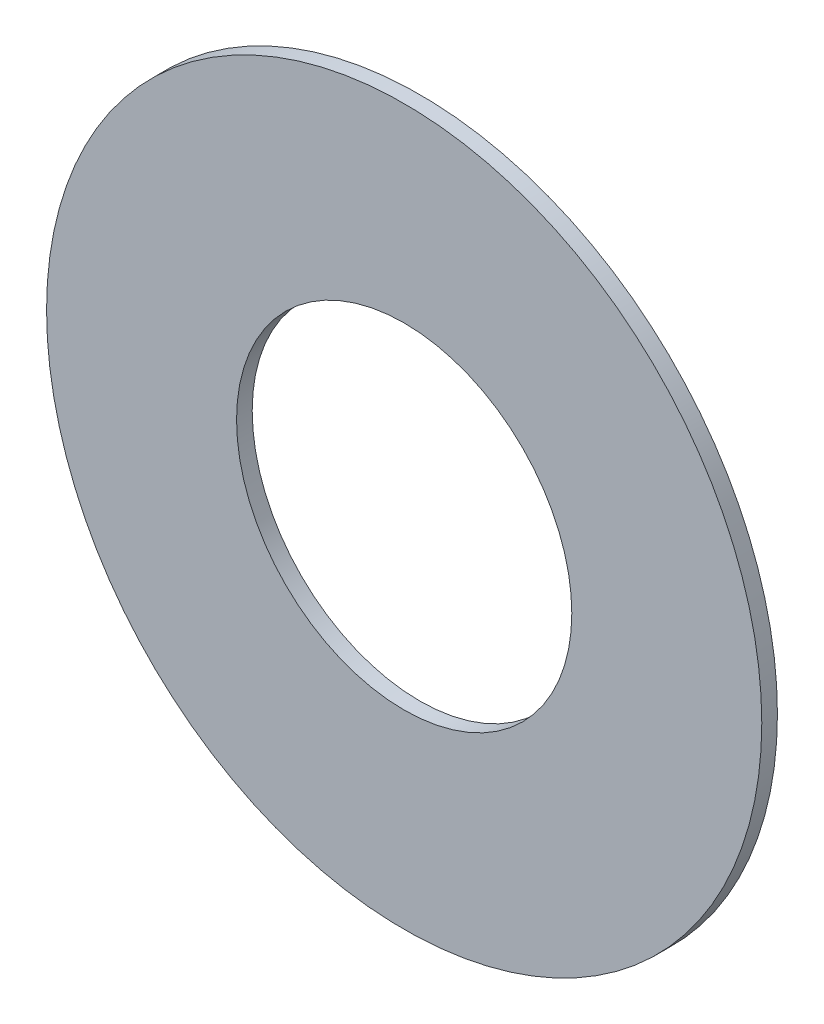
ISO-10303-21;
HEADER;
FILE_DESCRIPTION(('STEP AP214'),'2;1');
FILE_NAME('part.step','',(''),(''),'','','');
FILE_SCHEMA(('AUTOMOTIVE_DESIGN { 1 0 10303 214 1 1 1 1 }'));
ENDSEC;
DATA;
#1=APPLICATION_CONTEXT('core data for automotive mechanical design processes');
#2=APPLICATION_PROTOCOL_DEFINITION('international standard','automotive_design',2000,#1);
#3=PRODUCT_CONTEXT('',#1,'mechanical');
#4=PRODUCT('Part','Part','',(#3));
#5=PRODUCT_RELATED_PRODUCT_CATEGORY('part','',(#4));
#6=PRODUCT_DEFINITION_FORMATION('','',#4);
#7=PRODUCT_DEFINITION_CONTEXT('part definition',#1,'design');
#8=PRODUCT_DEFINITION('design','',#6,#7);
#9=PRODUCT_DEFINITION_SHAPE('','',#8);
#10=(LENGTH_UNIT() NAMED_UNIT(*) SI_UNIT(.MILLI.,.METRE.));
#11=(NAMED_UNIT(*) PLANE_ANGLE_UNIT() SI_UNIT($,.RADIAN.));
#12=(NAMED_UNIT(*) SI_UNIT($,.STERADIAN.) SOLID_ANGLE_UNIT());
#13=UNCERTAINTY_MEASURE_WITH_UNIT(LENGTH_MEASURE(1.E-05),#10,'distance_accuracy_value','');
#14=(GEOMETRIC_REPRESENTATION_CONTEXT(3) GLOBAL_UNCERTAINTY_ASSIGNED_CONTEXT((#13)) GLOBAL_UNIT_ASSIGNED_CONTEXT((#10,
#11,#12)) REPRESENTATION_CONTEXT('',''));
#15=CARTESIAN_POINT('',(0.,0.,0.));
#16=DIRECTION('',(0.,0.,1.));
#17=DIRECTION('',(1.,0.,0.));
#18=AXIS2_PLACEMENT_3D('',#15,#16,#17);
#19=CARTESIAN_POINT('',(117.856,-120.396,-0.045));
#20=DIRECTION('',(0.,0.,-1.));
#21=DIRECTION('',(0.,-1.,0.));
#22=AXIS2_PLACEMENT_3D('',#19,#20,#21);
#23=CYLINDRICAL_SURFACE('',#22,0.375);
#24=CARTESIAN_POINT('',(117.856,-120.396,1.67));
#25=DIRECTION('',(0.,0.,-1.));
#26=DIRECTION('',(0.,-1.,0.));
#27=AXIS2_PLACEMENT_3D('',#24,#25,#26);
#28=CIRCLE('',#27,0.375);
#29=CARTESIAN_POINT('',(117.856,-120.771,1.67));
#30=VERTEX_POINT('',#29);
#31=EDGE_CURVE('E25',#30,#30,#28,.T.);
#32=ORIENTED_EDGE('',*,*,#31,.T.);
#33=DIRECTION('',(0.,0.,1.));
#34=VECTOR('',#33,1.);
#35=CARTESIAN_POINT('',(117.856,-120.771,-0.045));
#36=LINE('',#35,#34);
#37=CARTESIAN_POINT('',(117.856,-120.771,1.705));
#38=VERTEX_POINT('',#37);
#39=EDGE_CURVE('E11',#30,#38,#36,.T.);
#40=ORIENTED_EDGE('',*,*,#39,.T.);
#41=CARTESIAN_POINT('',(117.856,-120.396,1.705));
#42=DIRECTION('',(0.,0.,-1.));
#43=DIRECTION('',(0.,-1.,0.));
#44=AXIS2_PLACEMENT_3D('',#41,#42,#43);
#45=CIRCLE('',#44,0.375);
#46=EDGE_CURVE('E69',#38,#38,#45,.T.);
#47=ORIENTED_EDGE('',*,*,#46,.F.);
#48=ORIENTED_EDGE('',*,*,#39,.F.);
#49=EDGE_LOOP('',(#32,#40,#47,#48));
#50=FACE_BOUND('',#49,.T.);
#51=ADVANCED_FACE('F17',(#50),#23,.F.);
#52=CARTESIAN_POINT('',(117.856,-120.396,1.67));
#53=DIRECTION('',(0.,0.,1.));
#54=DIRECTION('',(1.,0.,0.));
#55=AXIS2_PLACEMENT_3D('',#52,#53,#54);
#56=PLANE('',#55);
#57=ORIENTED_EDGE('',*,*,#31,.F.);
#58=EDGE_LOOP('',(#57));
#59=FACE_BOUND('',#58,.T.);
#60=CARTESIAN_POINT('',(117.856,-120.396,1.67));
#61=DIRECTION('',(0.,0.,1.));
#62=DIRECTION('',(1.,0.,0.));
#63=AXIS2_PLACEMENT_3D('',#60,#61,#62);
#64=CIRCLE('',#63,0.8);
#65=CARTESIAN_POINT('',(118.656,-120.396,1.67));
#66=VERTEX_POINT('',#65);
#67=EDGE_CURVE('E56',#66,#66,#64,.T.);
#68=ORIENTED_EDGE('',*,*,#67,.F.);
#69=EDGE_LOOP('',(#68));
#70=FACE_BOUND('',#69,.T.);
#71=ADVANCED_FACE('F76',(#59,#70),#56,.F.);
#72=CARTESIAN_POINT('',(117.856,-120.396,1.705));
#73=DIRECTION('',(0.,0.,1.));
#74=DIRECTION('',(1.,0.,0.));
#75=AXIS2_PLACEMENT_3D('',#72,#73,#74);
#76=PLANE('',#75);
#77=ORIENTED_EDGE('',*,*,#46,.T.);
#78=EDGE_LOOP('',(#77));
#79=FACE_BOUND('',#78,.T.);
#80=CARTESIAN_POINT('',(117.856,-120.396,1.705));
#81=DIRECTION('',(0.,0.,1.));
#82=DIRECTION('',(1.,0.,0.));
#83=AXIS2_PLACEMENT_3D('',#80,#81,#82);
#84=CIRCLE('',#83,0.8);
#85=CARTESIAN_POINT('',(118.656,-120.396,1.705));
#86=VERTEX_POINT('',#85);
#87=EDGE_CURVE('E54',#86,#86,#84,.T.);
#88=ORIENTED_EDGE('',*,*,#87,.T.);
#89=EDGE_LOOP('',(#88));
#90=FACE_BOUND('',#89,.T.);
#91=ADVANCED_FACE('F60',(#79,#90),#76,.T.);
#92=CARTESIAN_POINT('',(117.856,-120.396,1.67));
#93=DIRECTION('',(0.,0.,1.));
#94=DIRECTION('',(1.,0.,0.));
#95=AXIS2_PLACEMENT_3D('',#92,#93,#94);
#96=CYLINDRICAL_SURFACE('',#95,0.8);
#97=ORIENTED_EDGE('',*,*,#87,.F.);
#98=DIRECTION('',(0.,0.,1.));
#99=VECTOR('',#98,1.);
#100=CARTESIAN_POINT('',(118.656,-120.396,1.67));
#101=LINE('',#100,#99);
#102=EDGE_CURVE('E51',#66,#86,#101,.T.);
#103=ORIENTED_EDGE('',*,*,#102,.F.);
#104=ORIENTED_EDGE('',*,*,#67,.T.);
#105=ORIENTED_EDGE('',*,*,#102,.T.);
#106=EDGE_LOOP('',(#97,#103,#104,#105));
#107=FACE_BOUND('',#106,.T.);
#108=ADVANCED_FACE('F53',(#107),#96,.T.);
#109=CLOSED_SHELL('',(#51,#71,#91,#108));
#110=MANIFOLD_SOLID_BREP('B1',#109);
#111=ADVANCED_BREP_SHAPE_REPRESENTATION('',(#18,#110),#14);
#112=SHAPE_DEFINITION_REPRESENTATION(#9,#111);
ENDSEC;
END-ISO-10303-21;
